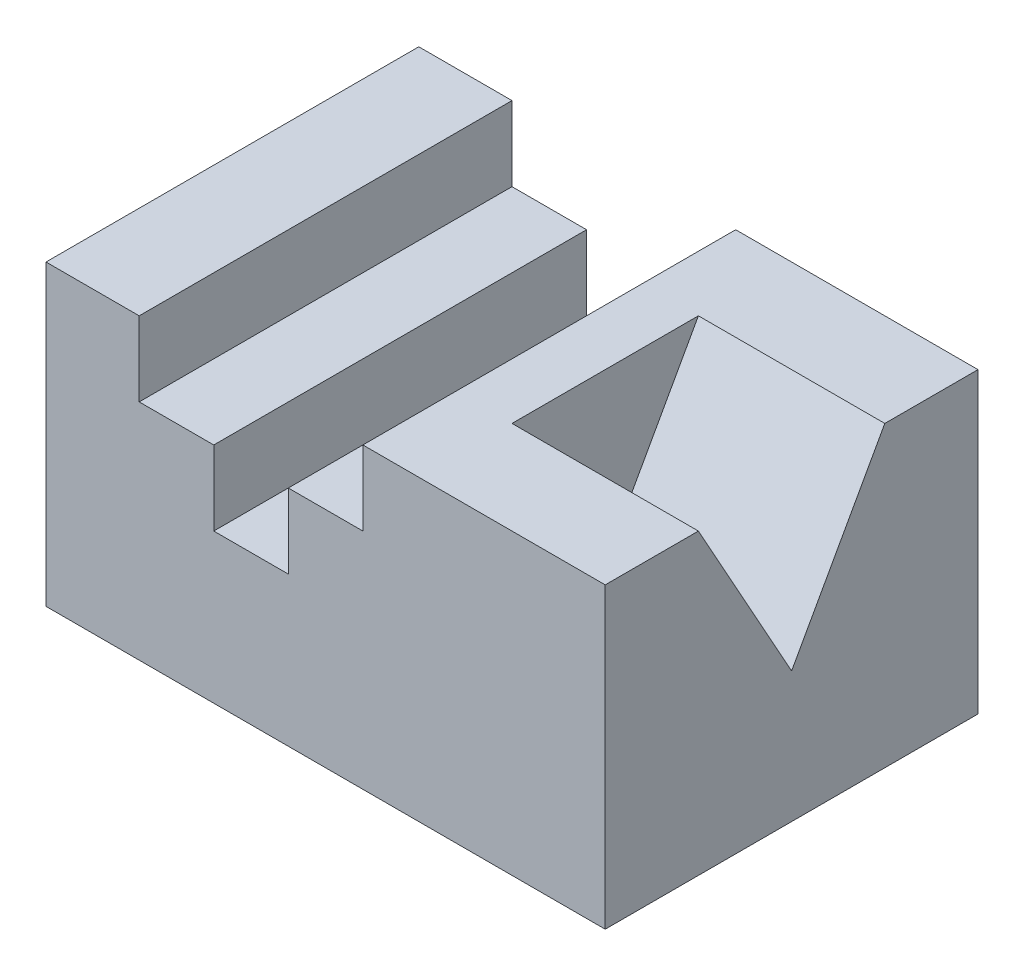
ISO-10303-21;
HEADER;
FILE_DESCRIPTION(('STEP AP214'),'2;1');
FILE_NAME('part.step','',(''),(''),'','','');
FILE_SCHEMA(('AUTOMOTIVE_DESIGN { 1 0 10303 214 1 1 1 1 }'));
ENDSEC;
DATA;
#1=APPLICATION_CONTEXT('core data for automotive mechanical design processes');
#2=APPLICATION_PROTOCOL_DEFINITION('international standard','automotive_design',2000,#1);
#3=PRODUCT_CONTEXT('',#1,'mechanical');
#4=PRODUCT('Part','Part','',(#3));
#5=PRODUCT_RELATED_PRODUCT_CATEGORY('part','',(#4));
#6=PRODUCT_DEFINITION_FORMATION('','',#4);
#7=PRODUCT_DEFINITION_CONTEXT('part definition',#1,'design');
#8=PRODUCT_DEFINITION('design','',#6,#7);
#9=PRODUCT_DEFINITION_SHAPE('','',#8);
#10=(LENGTH_UNIT() NAMED_UNIT(*) SI_UNIT(.MILLI.,.METRE.));
#11=(NAMED_UNIT(*) PLANE_ANGLE_UNIT() SI_UNIT($,.RADIAN.));
#12=(NAMED_UNIT(*) SI_UNIT($,.STERADIAN.) SOLID_ANGLE_UNIT());
#13=UNCERTAINTY_MEASURE_WITH_UNIT(LENGTH_MEASURE(1.E-05),#10,'distance_accuracy_value','');
#14=(GEOMETRIC_REPRESENTATION_CONTEXT(3) GLOBAL_UNCERTAINTY_ASSIGNED_CONTEXT((#13)) GLOBAL_UNIT_ASSIGNED_CONTEXT((#10,
#11,#12)) REPRESENTATION_CONTEXT('',''));
#15=CARTESIAN_POINT('',(0.,0.,0.));
#16=DIRECTION('',(0.,0.,1.));
#17=DIRECTION('',(1.,0.,0.));
#18=AXIS2_PLACEMENT_3D('',#15,#16,#17);
#19=CARTESIAN_POINT('',(-46.6201716738197,15.0160944206009,-100.));
#20=DIRECTION('',(0.,-1.,0.));
#21=DIRECTION('',(0.,0.,-1.));
#22=AXIS2_PLACEMENT_3D('',#19,#20,#21);
#23=PLANE('',#22);
#24=DIRECTION('',(1.,0.,0.));
#25=VECTOR('',#24,1.);
#26=CARTESIAN_POINT('',(-46.6201716738197,15.0160944206009,0.));
#27=LINE('',#26,#25);
#28=CARTESIAN_POINT('',(-46.6201716738197,15.0160944206009,0.));
#29=VERTEX_POINT('',#28);
#30=CARTESIAN_POINT('',(-26.6201716738197,15.0160944206009,0.));
#31=VERTEX_POINT('',#30);
#32=EDGE_CURVE('E239',#29,#31,#27,.T.);
#33=ORIENTED_EDGE('',*,*,#32,.T.);
#34=DIRECTION('',(0.,0.,1.));
#35=VECTOR('',#34,1.);
#36=CARTESIAN_POINT('',(-26.6201716738197,15.0160944206009,-100.));
#37=LINE('',#36,#35);
#38=CARTESIAN_POINT('',(-26.6201716738197,15.0160944206009,-100.));
#39=VERTEX_POINT('',#38);
#40=EDGE_CURVE('E209',#39,#31,#37,.T.);
#41=ORIENTED_EDGE('',*,*,#40,.F.);
#42=DIRECTION('',(1.,0.,0.));
#43=VECTOR('',#42,1.);
#44=CARTESIAN_POINT('',(-46.6201716738197,15.0160944206009,-100.));
#45=LINE('',#44,#43);
#46=CARTESIAN_POINT('',(-46.6201716738197,15.0160944206009,-100.));
#47=VERTEX_POINT('',#46);
#48=EDGE_CURVE('E227',#47,#39,#45,.T.);
#49=ORIENTED_EDGE('',*,*,#48,.F.);
#50=DIRECTION('',(0.,0.,1.));
#51=VECTOR('',#50,1.);
#52=CARTESIAN_POINT('',(-46.6201716738197,15.0160944206009,-100.));
#53=LINE('',#52,#51);
#54=EDGE_CURVE('E235',#47,#29,#53,.T.);
#55=ORIENTED_EDGE('',*,*,#54,.T.);
#56=EDGE_LOOP('',(#33,#41,#49,#55));
#57=FACE_BOUND('',#56,.T.);
#58=ADVANCED_FACE('F45',(#57),#23,.F.);
#59=CARTESIAN_POINT('',(-71.6201716738197,35.0160944206009,-100.));
#60=DIRECTION('',(0.,1.,0.));
#61=DIRECTION('',(0.,0.,1.));
#62=AXIS2_PLACEMENT_3D('',#59,#60,#61);
#63=PLANE('',#62);
#64=DIRECTION('',(0.,0.,1.));
#65=VECTOR('',#64,1.);
#66=CARTESIAN_POINT('',(-46.6201716738198,35.0160944206009,-100.));
#67=LINE('',#66,#65);
#68=CARTESIAN_POINT('',(-46.6201716738198,35.0160944206009,-100.));
#69=VERTEX_POINT('',#68);
#70=CARTESIAN_POINT('',(-46.6201716738198,35.0160944206009,0.));
#71=VERTEX_POINT('',#70);
#72=EDGE_CURVE('E245',#69,#71,#67,.T.);
#73=ORIENTED_EDGE('',*,*,#72,.F.);
#74=DIRECTION('',(-1.,0.,0.));
#75=VECTOR('',#74,1.);
#76=CARTESIAN_POINT('',(-71.6201716738197,35.0160944206009,-100.));
#77=LINE('',#76,#75);
#78=CARTESIAN_POINT('',(-71.6201716738197,35.0160944206009,-100.));
#79=VERTEX_POINT('',#78);
#80=EDGE_CURVE('E273',#69,#79,#77,.T.);
#81=ORIENTED_EDGE('',*,*,#80,.T.);
#82=DIRECTION('',(0.,0.,1.));
#83=VECTOR('',#82,1.);
#84=CARTESIAN_POINT('',(-71.6201716738197,35.0160944206009,-100.));
#85=LINE('',#84,#83);
#86=CARTESIAN_POINT('',(-71.6201716738197,35.0160944206009,0.));
#87=VERTEX_POINT('',#86);
#88=EDGE_CURVE('E11',#79,#87,#85,.T.);
#89=ORIENTED_EDGE('',*,*,#88,.T.);
#90=DIRECTION('',(-1.,0.,0.));
#91=VECTOR('',#90,1.);
#92=CARTESIAN_POINT('',(-71.6201716738197,35.0160944206009,0.));
#93=LINE('',#92,#91);
#94=EDGE_CURVE('E289',#71,#87,#93,.T.);
#95=ORIENTED_EDGE('',*,*,#94,.F.);
#96=EDGE_LOOP('',(#73,#81,#89,#95));
#97=FACE_BOUND('',#96,.T.);
#98=ADVANCED_FACE('F318',(#97),#63,.T.);
#99=CARTESIAN_POINT('',(-71.6201716738197,35.0160944206009,-100.));
#100=DIRECTION('',(-1.,0.,0.));
#101=DIRECTION('',(0.,0.,1.));
#102=AXIS2_PLACEMENT_3D('',#99,#100,#101);
#103=PLANE('',#102);
#104=DIRECTION('',(0.,-1.,0.));
#105=VECTOR('',#104,1.);
#106=CARTESIAN_POINT('',(-71.6201716738197,35.0160944206009,0.));
#107=LINE('',#106,#105);
#108=CARTESIAN_POINT('',(-71.6201716738197,-44.9839055793991,0.));
#109=VERTEX_POINT('',#108);
#110=EDGE_CURVE('E248',#87,#109,#107,.T.);
#111=ORIENTED_EDGE('',*,*,#110,.F.);
#112=ORIENTED_EDGE('',*,*,#88,.F.);
#113=DIRECTION('',(0.,-1.,0.));
#114=VECTOR('',#113,1.);
#115=CARTESIAN_POINT('',(-71.6201716738197,35.0160944206009,-100.));
#116=LINE('',#115,#114);
#117=CARTESIAN_POINT('',(-71.6201716738197,-44.9839055793991,-100.));
#118=VERTEX_POINT('',#117);
#119=EDGE_CURVE('E260',#79,#118,#116,.T.);
#120=ORIENTED_EDGE('',*,*,#119,.T.);
#121=DIRECTION('',(0.,0.,1.));
#122=VECTOR('',#121,1.);
#123=CARTESIAN_POINT('',(-71.6201716738197,-44.9839055793991,-100.));
#124=LINE('',#123,#122);
#125=EDGE_CURVE('E49',#118,#109,#124,.T.);
#126=ORIENTED_EDGE('',*,*,#125,.T.);
#127=EDGE_LOOP('',(#111,#112,#120,#126));
#128=FACE_BOUND('',#127,.T.);
#129=ADVANCED_FACE('F47',(#128),#103,.T.);
#130=DIRECTION('',(-1.,0.,0.));
#131=VECTOR('',#130,1.);
#132=CARTESIAN_POINT('',(456.168364867631,35.0160944206009,-75.));
#133=LINE('',#132,#131);
#134=CARTESIAN_POINT('',(78.3798283261802,35.0160944206009,-75.));
#135=VERTEX_POINT('',#134);
#136=CARTESIAN_POINT('',(28.3798283261802,35.0160944206009,-75.));
#137=VERTEX_POINT('',#136);
#138=EDGE_CURVE('E63',#135,#137,#133,.T.);
#139=ORIENTED_EDGE('',*,*,#138,.F.);
#140=DIRECTION('',(0.,0.,1.));
#141=VECTOR('',#140,1.);
#142=CARTESIAN_POINT('',(78.3798283261802,35.0160944206009,-100.));
#143=LINE('',#142,#141);
#144=CARTESIAN_POINT('',(78.3798283261802,35.0160944206009,-100.));
#145=VERTEX_POINT('',#144);
#146=EDGE_CURVE('E55',#145,#135,#143,.T.);
#147=ORIENTED_EDGE('',*,*,#146,.F.);
#148=CARTESIAN_POINT('',(13.3798283261803,35.0160944206009,-100.));
#149=VERTEX_POINT('',#148);
#150=EDGE_CURVE('E274',#145,#149,#77,.T.);
#151=ORIENTED_EDGE('',*,*,#150,.T.);
#152=DIRECTION('',(0.,0.,1.));
#153=VECTOR('',#152,1.);
#154=CARTESIAN_POINT('',(13.3798283261803,35.0160944206009,-100.));
#155=LINE('',#154,#153);
#156=CARTESIAN_POINT('',(13.3798283261803,35.0160944206009,0.));
#157=VERTEX_POINT('',#156);
#158=EDGE_CURVE('E249',#149,#157,#155,.T.);
#159=ORIENTED_EDGE('',*,*,#158,.T.);
#160=CARTESIAN_POINT('',(78.3798283261802,35.0160944206009,0.));
#161=VERTEX_POINT('',#160);
#162=EDGE_CURVE('E265',#161,#157,#93,.T.);
#163=ORIENTED_EDGE('',*,*,#162,.F.);
#164=CARTESIAN_POINT('',(78.3798283261802,35.0160944206009,-25.));
#165=VERTEX_POINT('',#164);
#166=EDGE_CURVE('E295',#165,#161,#143,.T.);
#167=ORIENTED_EDGE('',*,*,#166,.F.);
#168=DIRECTION('',(-1.,0.,0.));
#169=VECTOR('',#168,1.);
#170=CARTESIAN_POINT('',(456.168364867631,35.0160944206009,-25.));
#171=LINE('',#170,#169);
#172=CARTESIAN_POINT('',(28.3798283261802,35.0160944206009,-25.));
#173=VERTEX_POINT('',#172);
#174=EDGE_CURVE('E170',#165,#173,#171,.T.);
#175=ORIENTED_EDGE('',*,*,#174,.T.);
#176=DIRECTION('',(0.,0.,1.));
#177=VECTOR('',#176,1.);
#178=CARTESIAN_POINT('',(28.3798283261802,35.0160944206009,-100.));
#179=LINE('',#178,#177);
#180=EDGE_CURVE('E159',#137,#173,#179,.T.);
#181=ORIENTED_EDGE('',*,*,#180,.F.);
#182=EDGE_LOOP('',(#139,#147,#151,#159,#163,#167,#175,#181));
#183=FACE_BOUND('',#182,.T.);
#184=ADVANCED_FACE('F330',(#183),#63,.T.);
#185=CARTESIAN_POINT('',(78.3798283261802,35.0160944206009,-100.));
#186=DIRECTION('',(1.,0.,0.));
#187=DIRECTION('',(0.,0.,-1.));
#188=AXIS2_PLACEMENT_3D('',#185,#186,#187);
#189=PLANE('',#188);
#190=DIRECTION('',(0.,0.874157276121538,-0.485642931178632));
#191=VECTOR('',#190,1.);
#192=CARTESIAN_POINT('',(78.3798283261802,-9.98390557939914,-50.));
#193=LINE('',#192,#191);
#194=CARTESIAN_POINT('',(78.3798283261802,-9.98390557939914,-50.));
#195=VERTEX_POINT('',#194);
#196=EDGE_CURVE('E176',#195,#135,#193,.T.);
#197=ORIENTED_EDGE('',*,*,#196,.F.);
#198=DIRECTION('',(0.,-0.874157276121538,-0.485642931178632));
#199=VECTOR('',#198,1.);
#200=CARTESIAN_POINT('',(78.3798283261802,35.0160944206009,-25.));
#201=LINE('',#200,#199);
#202=EDGE_CURVE('E174',#165,#195,#201,.T.);
#203=ORIENTED_EDGE('',*,*,#202,.F.);
#204=ORIENTED_EDGE('',*,*,#166,.T.);
#205=DIRECTION('',(0.,1.,0.));
#206=VECTOR('',#205,1.);
#207=CARTESIAN_POINT('',(78.3798283261802,35.0160944206009,0.));
#208=LINE('',#207,#206);
#209=CARTESIAN_POINT('',(78.3798283261802,-44.9839055793991,0.));
#210=VERTEX_POINT('',#209);
#211=EDGE_CURVE('E285',#210,#161,#208,.T.);
#212=ORIENTED_EDGE('',*,*,#211,.F.);
#213=DIRECTION('',(0.,0.,1.));
#214=VECTOR('',#213,1.);
#215=CARTESIAN_POINT('',(78.3798283261802,-44.9839055793991,-100.));
#216=LINE('',#215,#214);
#217=CARTESIAN_POINT('',(78.3798283261802,-44.9839055793991,-100.));
#218=VERTEX_POINT('',#217);
#219=EDGE_CURVE('E296',#218,#210,#216,.T.);
#220=ORIENTED_EDGE('',*,*,#219,.F.);
#221=DIRECTION('',(0.,1.,0.));
#222=VECTOR('',#221,1.);
#223=CARTESIAN_POINT('',(78.3798283261802,35.0160944206009,-100.));
#224=LINE('',#223,#222);
#225=EDGE_CURVE('E269',#218,#145,#224,.T.);
#226=ORIENTED_EDGE('',*,*,#225,.T.);
#227=ORIENTED_EDGE('',*,*,#146,.T.);
#228=EDGE_LOOP('',(#197,#203,#204,#212,#220,#226,#227));
#229=FACE_BOUND('',#228,.T.);
#230=ADVANCED_FACE('F325',(#229),#189,.T.);
#231=CARTESIAN_POINT('',(-71.6201716738197,-44.9839055793991,-100.));
#232=DIRECTION('',(0.,-1.,0.));
#233=DIRECTION('',(0.,0.,-1.));
#234=AXIS2_PLACEMENT_3D('',#231,#232,#233);
#235=PLANE('',#234);
#236=DIRECTION('',(1.,0.,0.));
#237=VECTOR('',#236,1.);
#238=CARTESIAN_POINT('',(-71.6201716738197,-44.9839055793991,0.));
#239=LINE('',#238,#237);
#240=EDGE_CURVE('E281',#109,#210,#239,.T.);
#241=ORIENTED_EDGE('',*,*,#240,.F.);
#242=ORIENTED_EDGE('',*,*,#125,.F.);
#243=DIRECTION('',(1.,0.,0.));
#244=VECTOR('',#243,1.);
#245=CARTESIAN_POINT('',(-71.6201716738197,-44.9839055793991,-100.));
#246=LINE('',#245,#244);
#247=EDGE_CURVE('E264',#118,#218,#246,.T.);
#248=ORIENTED_EDGE('',*,*,#247,.T.);
#249=ORIENTED_EDGE('',*,*,#219,.T.);
#250=EDGE_LOOP('',(#241,#242,#248,#249));
#251=FACE_BOUND('',#250,.T.);
#252=ADVANCED_FACE('F308',(#251),#235,.T.);
#253=CARTESIAN_POINT('',(0.,0.,-100.));
#254=DIRECTION('',(0.,0.,1.));
#255=DIRECTION('',(1.,0.,0.));
#256=AXIS2_PLACEMENT_3D('',#253,#254,#255);
#257=PLANE('',#256);
#258=ORIENTED_EDGE('',*,*,#48,.T.);
#259=DIRECTION('',(0.,-1.,0.));
#260=VECTOR('',#259,1.);
#261=CARTESIAN_POINT('',(-26.6201716738197,15.0160944206009,-100.));
#262=LINE('',#261,#260);
#263=CARTESIAN_POINT('',(-26.6201716738197,-4.98390557939914,-100.));
#264=VERTEX_POINT('',#263);
#265=EDGE_CURVE('E186',#39,#264,#262,.T.);
#266=ORIENTED_EDGE('',*,*,#265,.T.);
#267=DIRECTION('',(1.,0.,0.));
#268=VECTOR('',#267,1.);
#269=CARTESIAN_POINT('',(-26.6201716738197,-4.98390557939914,-100.));
#270=LINE('',#269,#268);
#271=CARTESIAN_POINT('',(-6.62017167381974,-4.98390557939914,-100.));
#272=VERTEX_POINT('',#271);
#273=EDGE_CURVE('E190',#264,#272,#270,.T.);
#274=ORIENTED_EDGE('',*,*,#273,.T.);
#275=DIRECTION('',(0.,1.,0.));
#276=VECTOR('',#275,1.);
#277=CARTESIAN_POINT('',(-6.62017167381974,15.0160944206009,-100.));
#278=LINE('',#277,#276);
#279=CARTESIAN_POINT('',(-6.62017167381974,15.0160944206009,-100.));
#280=VERTEX_POINT('',#279);
#281=EDGE_CURVE('E194',#272,#280,#278,.T.);
#282=ORIENTED_EDGE('',*,*,#281,.T.);
#283=CARTESIAN_POINT('',(13.3798283261803,15.0160944206009,-100.));
#284=VERTEX_POINT('',#283);
#285=EDGE_CURVE('E225',#280,#284,#45,.T.);
#286=ORIENTED_EDGE('',*,*,#285,.T.);
#287=DIRECTION('',(0.,1.,0.));
#288=VECTOR('',#287,1.);
#289=CARTESIAN_POINT('',(13.3798283261803,35.0160944206009,-100.));
#290=LINE('',#289,#288);
#291=EDGE_CURVE('E231',#284,#149,#290,.T.);
#292=ORIENTED_EDGE('',*,*,#291,.T.);
#293=ORIENTED_EDGE('',*,*,#150,.F.);
#294=ORIENTED_EDGE('',*,*,#225,.F.);
#295=ORIENTED_EDGE('',*,*,#247,.F.);
#296=ORIENTED_EDGE('',*,*,#119,.F.);
#297=ORIENTED_EDGE('',*,*,#80,.F.);
#298=DIRECTION('',(0.,-1.,0.));
#299=VECTOR('',#298,1.);
#300=CARTESIAN_POINT('',(-46.6201716738198,35.0160944206009,-100.));
#301=LINE('',#300,#299);
#302=EDGE_CURVE('E221',#69,#47,#301,.T.);
#303=ORIENTED_EDGE('',*,*,#302,.T.);
#304=EDGE_LOOP('',(#258,#266,#274,#282,#286,#292,#293,#294,#295,#296,#297,#303));
#305=FACE_BOUND('',#304,.T.);
#306=ADVANCED_FACE('F321',(#305),#257,.F.);
#307=CARTESIAN_POINT('',(0.,0.,0.));
#308=DIRECTION('',(0.,0.,1.));
#309=DIRECTION('',(1.,0.,0.));
#310=AXIS2_PLACEMENT_3D('',#307,#308,#309);
#311=PLANE('',#310);
#312=DIRECTION('',(0.,-1.,0.));
#313=VECTOR('',#312,1.);
#314=CARTESIAN_POINT('',(-26.6201716738197,15.0160944206009,0.));
#315=LINE('',#314,#313);
#316=CARTESIAN_POINT('',(-26.6201716738197,-4.98390557939914,0.));
#317=VERTEX_POINT('',#316);
#318=EDGE_CURVE('E199',#31,#317,#315,.T.);
#319=ORIENTED_EDGE('',*,*,#318,.F.);
#320=ORIENTED_EDGE('',*,*,#32,.F.);
#321=DIRECTION('',(0.,-1.,0.));
#322=VECTOR('',#321,1.);
#323=CARTESIAN_POINT('',(-46.6201716738198,35.0160944206009,0.));
#324=LINE('',#323,#322);
#325=EDGE_CURVE('E212',#71,#29,#324,.T.);
#326=ORIENTED_EDGE('',*,*,#325,.F.);
#327=ORIENTED_EDGE('',*,*,#94,.T.);
#328=ORIENTED_EDGE('',*,*,#110,.T.);
#329=ORIENTED_EDGE('',*,*,#240,.T.);
#330=ORIENTED_EDGE('',*,*,#211,.T.);
#331=ORIENTED_EDGE('',*,*,#162,.T.);
#332=DIRECTION('',(0.,1.,0.));
#333=VECTOR('',#332,1.);
#334=CARTESIAN_POINT('',(13.3798283261803,35.0160944206009,0.));
#335=LINE('',#334,#333);
#336=CARTESIAN_POINT('',(13.3798283261803,15.0160944206009,0.));
#337=VERTEX_POINT('',#336);
#338=EDGE_CURVE('E226',#337,#157,#335,.T.);
#339=ORIENTED_EDGE('',*,*,#338,.F.);
#340=CARTESIAN_POINT('',(-6.62017167381974,15.0160944206009,0.));
#341=VERTEX_POINT('',#340);
#342=EDGE_CURVE('E238',#341,#337,#27,.T.);
#343=ORIENTED_EDGE('',*,*,#342,.F.);
#344=DIRECTION('',(0.,1.,0.));
#345=VECTOR('',#344,1.);
#346=CARTESIAN_POINT('',(-6.62017167381974,15.0160944206009,0.));
#347=LINE('',#346,#345);
#348=CARTESIAN_POINT('',(-6.62017167381974,-4.98390557939914,0.));
#349=VERTEX_POINT('',#348);
#350=EDGE_CURVE('E71',#349,#341,#347,.T.);
#351=ORIENTED_EDGE('',*,*,#350,.F.);
#352=DIRECTION('',(1.,0.,0.));
#353=VECTOR('',#352,1.);
#354=CARTESIAN_POINT('',(-26.6201716738197,-4.98390557939914,0.));
#355=LINE('',#354,#353);
#356=EDGE_CURVE('E203',#317,#349,#355,.T.);
#357=ORIENTED_EDGE('',*,*,#356,.F.);
#358=EDGE_LOOP('',(#319,#320,#326,#327,#328,#329,#330,#331,#339,#343,#351,#357));
#359=FACE_BOUND('',#358,.T.);
#360=ADVANCED_FACE('F311',(#359),#311,.T.);
#361=CARTESIAN_POINT('',(-46.6201716738198,35.0160944206009,-100.));
#362=DIRECTION('',(-1.,0.,0.));
#363=DIRECTION('',(0.,-1.,0.));
#364=AXIS2_PLACEMENT_3D('',#361,#362,#363);
#365=PLANE('',#364);
#366=ORIENTED_EDGE('',*,*,#325,.T.);
#367=ORIENTED_EDGE('',*,*,#54,.F.);
#368=ORIENTED_EDGE('',*,*,#302,.F.);
#369=ORIENTED_EDGE('',*,*,#72,.T.);
#370=EDGE_LOOP('',(#366,#367,#368,#369));
#371=FACE_BOUND('',#370,.T.);
#372=ADVANCED_FACE('F356',(#371),#365,.F.);
#373=CARTESIAN_POINT('',(13.3798283261803,35.0160944206009,-100.));
#374=DIRECTION('',(1.,0.,0.));
#375=DIRECTION('',(0.,0.,-1.));
#376=AXIS2_PLACEMENT_3D('',#373,#374,#375);
#377=PLANE('',#376);
#378=ORIENTED_EDGE('',*,*,#338,.T.);
#379=ORIENTED_EDGE('',*,*,#158,.F.);
#380=ORIENTED_EDGE('',*,*,#291,.F.);
#381=DIRECTION('',(0.,0.,1.));
#382=VECTOR('',#381,1.);
#383=CARTESIAN_POINT('',(13.3798283261803,15.0160944206009,-100.));
#384=LINE('',#383,#382);
#385=EDGE_CURVE('E253',#284,#337,#384,.T.);
#386=ORIENTED_EDGE('',*,*,#385,.T.);
#387=EDGE_LOOP('',(#378,#379,#380,#386));
#388=FACE_BOUND('',#387,.T.);
#389=ADVANCED_FACE('F333',(#388),#377,.F.);
#390=ORIENTED_EDGE('',*,*,#285,.F.);
#391=DIRECTION('',(0.,0.,1.));
#392=VECTOR('',#391,1.);
#393=CARTESIAN_POINT('',(-6.62017167381974,15.0160944206009,-100.));
#394=LINE('',#393,#392);
#395=EDGE_CURVE('E213',#280,#341,#394,.T.);
#396=ORIENTED_EDGE('',*,*,#395,.T.);
#397=ORIENTED_EDGE('',*,*,#342,.T.);
#398=ORIENTED_EDGE('',*,*,#385,.F.);
#399=EDGE_LOOP('',(#390,#396,#397,#398));
#400=FACE_BOUND('',#399,.T.);
#401=ADVANCED_FACE('F339',(#400),#23,.F.);
#402=CARTESIAN_POINT('',(-26.6201716738197,15.0160944206009,-100.));
#403=DIRECTION('',(-1.,0.,0.));
#404=DIRECTION('',(0.,-1.,0.));
#405=AXIS2_PLACEMENT_3D('',#402,#403,#404);
#406=PLANE('',#405);
#407=ORIENTED_EDGE('',*,*,#318,.T.);
#408=DIRECTION('',(0.,0.,1.));
#409=VECTOR('',#408,1.);
#410=CARTESIAN_POINT('',(-26.6201716738197,-4.98390557939914,-100.));
#411=LINE('',#410,#409);
#412=EDGE_CURVE('E198',#264,#317,#411,.T.);
#413=ORIENTED_EDGE('',*,*,#412,.F.);
#414=ORIENTED_EDGE('',*,*,#265,.F.);
#415=ORIENTED_EDGE('',*,*,#40,.T.);
#416=EDGE_LOOP('',(#407,#413,#414,#415));
#417=FACE_BOUND('',#416,.T.);
#418=ADVANCED_FACE('F351',(#417),#406,.F.);
#419=CARTESIAN_POINT('',(-6.62017167381974,15.0160944206009,-100.));
#420=DIRECTION('',(1.,0.,0.));
#421=DIRECTION('',(0.,0.,-1.));
#422=AXIS2_PLACEMENT_3D('',#419,#420,#421);
#423=PLANE('',#422);
#424=ORIENTED_EDGE('',*,*,#350,.T.);
#425=ORIENTED_EDGE('',*,*,#395,.F.);
#426=ORIENTED_EDGE('',*,*,#281,.F.);
#427=DIRECTION('',(0.,0.,1.));
#428=VECTOR('',#427,1.);
#429=CARTESIAN_POINT('',(-6.62017167381974,-4.98390557939914,-100.));
#430=LINE('',#429,#428);
#431=EDGE_CURVE('E216',#272,#349,#430,.T.);
#432=ORIENTED_EDGE('',*,*,#431,.T.);
#433=EDGE_LOOP('',(#424,#425,#426,#432));
#434=FACE_BOUND('',#433,.T.);
#435=ADVANCED_FACE('F377',(#434),#423,.F.);
#436=CARTESIAN_POINT('',(-26.6201716738197,-4.98390557939914,-100.));
#437=DIRECTION('',(0.,-1.,0.));
#438=DIRECTION('',(0.,0.,-1.));
#439=AXIS2_PLACEMENT_3D('',#436,#437,#438);
#440=PLANE('',#439);
#441=ORIENTED_EDGE('',*,*,#356,.T.);
#442=ORIENTED_EDGE('',*,*,#431,.F.);
#443=ORIENTED_EDGE('',*,*,#273,.F.);
#444=ORIENTED_EDGE('',*,*,#412,.T.);
#445=EDGE_LOOP('',(#441,#442,#443,#444));
#446=FACE_BOUND('',#445,.T.);
#447=ADVANCED_FACE('F348',(#446),#440,.F.);
#448=CARTESIAN_POINT('',(456.168364867631,-9.98390557939914,-50.));
#449=DIRECTION('',(0.,0.485642931178632,0.874157276121538));
#450=DIRECTION('',(0.,-0.874157276121538,0.485642931178632));
#451=AXIS2_PLACEMENT_3D('',#448,#449,#450);
#452=PLANE('',#451);
#453=DIRECTION('',(-1.,0.,0.));
#454=VECTOR('',#453,1.);
#455=CARTESIAN_POINT('',(456.168364867631,-9.98390557939914,-50.));
#456=LINE('',#455,#454);
#457=CARTESIAN_POINT('',(28.3798283261802,-9.98390557939914,-50.));
#458=VERTEX_POINT('',#457);
#459=EDGE_CURVE('E167',#195,#458,#456,.T.);
#460=ORIENTED_EDGE('',*,*,#459,.F.);
#461=ORIENTED_EDGE('',*,*,#196,.T.);
#462=ORIENTED_EDGE('',*,*,#138,.T.);
#463=DIRECTION('',(0.,0.874157276121538,-0.485642931178632));
#464=VECTOR('',#463,1.);
#465=CARTESIAN_POINT('',(28.3798283261802,-9.98390557939914,-50.));
#466=LINE('',#465,#464);
#467=EDGE_CURVE('E157',#458,#137,#466,.T.);
#468=ORIENTED_EDGE('',*,*,#467,.F.);
#469=EDGE_LOOP('',(#460,#461,#462,#468));
#470=FACE_BOUND('',#469,.T.);
#471=ADVANCED_FACE('F166',(#470),#452,.T.);
#472=CARTESIAN_POINT('',(456.168364867631,35.0160944206009,-25.));
#473=DIRECTION('',(0.,0.485642931178632,-0.874157276121538));
#474=DIRECTION('',(0.,0.874157276121538,0.485642931178632));
#475=AXIS2_PLACEMENT_3D('',#472,#473,#474);
#476=PLANE('',#475);
#477=ORIENTED_EDGE('',*,*,#174,.F.);
#478=ORIENTED_EDGE('',*,*,#202,.T.);
#479=ORIENTED_EDGE('',*,*,#459,.T.);
#480=DIRECTION('',(0.,-0.874157276121538,-0.485642931178632));
#481=VECTOR('',#480,1.);
#482=CARTESIAN_POINT('',(28.3798283261802,35.0160944206009,-25.));
#483=LINE('',#482,#481);
#484=EDGE_CURVE('E155',#173,#458,#483,.T.);
#485=ORIENTED_EDGE('',*,*,#484,.F.);
#486=EDGE_LOOP('',(#477,#478,#479,#485));
#487=FACE_BOUND('',#486,.T.);
#488=ADVANCED_FACE('F172',(#487),#476,.T.);
#489=CARTESIAN_POINT('',(28.3798283261802,35.0160944206009,-100.));
#490=DIRECTION('',(1.,0.,0.));
#491=DIRECTION('',(0.,0.,-1.));
#492=AXIS2_PLACEMENT_3D('',#489,#490,#491);
#493=PLANE('',#492);
#494=ORIENTED_EDGE('',*,*,#484,.T.);
#495=ORIENTED_EDGE('',*,*,#467,.T.);
#496=ORIENTED_EDGE('',*,*,#180,.T.);
#497=EDGE_LOOP('',(#494,#495,#496));
#498=FACE_BOUND('',#497,.T.);
#499=ADVANCED_FACE('F156',(#498),#493,.T.);
#500=CLOSED_SHELL('',(#58,#98,#129,#184,#230,#252,#306,#360,#372,#389,#401,#418,#435,#447,#471,
#488,#499));
#501=MANIFOLD_SOLID_BREP('B2',#500);
#502=ADVANCED_BREP_SHAPE_REPRESENTATION('',(#18,#501),#14);
#503=SHAPE_DEFINITION_REPRESENTATION(#9,#502);
ENDSEC;
END-ISO-10303-21;
